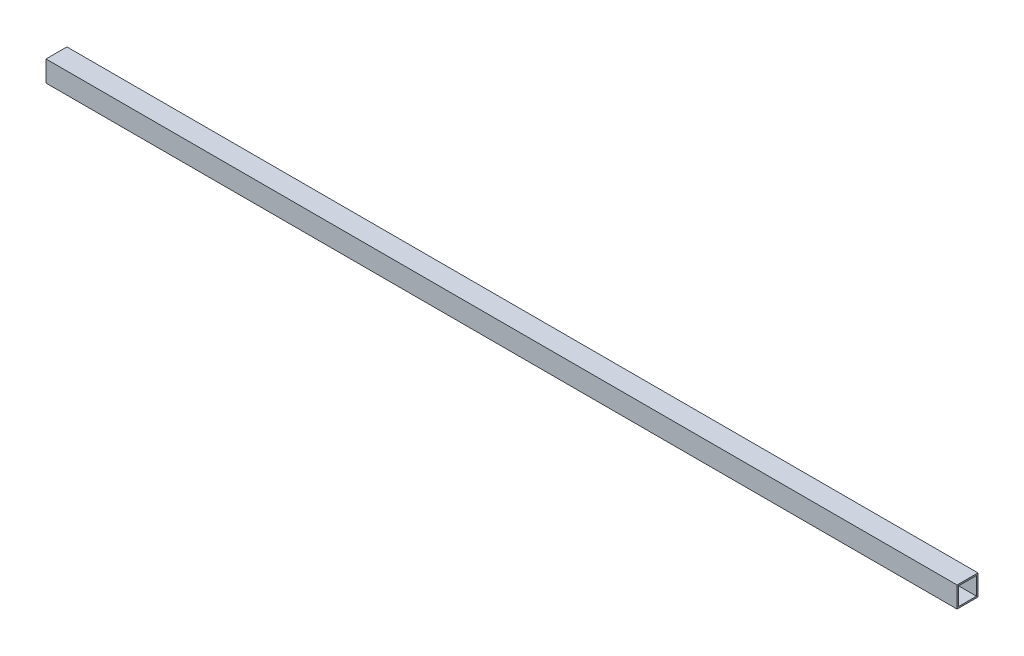
ISO-10303-21;
HEADER;
FILE_DESCRIPTION(('STEP AP214'),'2;1');
FILE_NAME('part.step','',(''),(''),'','','');
FILE_SCHEMA(('AUTOMOTIVE_DESIGN { 1 0 10303 214 1 1 1 1 }'));
ENDSEC;
DATA;
#1=APPLICATION_CONTEXT('core data for automotive mechanical design processes');
#2=APPLICATION_PROTOCOL_DEFINITION('international standard','automotive_design',2000,#1);
#3=PRODUCT_CONTEXT('',#1,'mechanical');
#4=PRODUCT('Part','Part','',(#3));
#5=PRODUCT_RELATED_PRODUCT_CATEGORY('part','',(#4));
#6=PRODUCT_DEFINITION_FORMATION('','',#4);
#7=PRODUCT_DEFINITION_CONTEXT('part definition',#1,'design');
#8=PRODUCT_DEFINITION('design','',#6,#7);
#9=PRODUCT_DEFINITION_SHAPE('','',#8);
#10=(LENGTH_UNIT() NAMED_UNIT(*) SI_UNIT(.MILLI.,.METRE.));
#11=(NAMED_UNIT(*) PLANE_ANGLE_UNIT() SI_UNIT($,.RADIAN.));
#12=(NAMED_UNIT(*) SI_UNIT($,.STERADIAN.) SOLID_ANGLE_UNIT());
#13=UNCERTAINTY_MEASURE_WITH_UNIT(LENGTH_MEASURE(1.E-05),#10,'distance_accuracy_value','');
#14=(GEOMETRIC_REPRESENTATION_CONTEXT(3) GLOBAL_UNCERTAINTY_ASSIGNED_CONTEXT((#13)) GLOBAL_UNIT_ASSIGNED_CONTEXT((#10,
#11,#12)) REPRESENTATION_CONTEXT('',''));
#15=CARTESIAN_POINT('',(0.,0.,0.));
#16=DIRECTION('',(0.,0.,1.));
#17=DIRECTION('',(1.,0.,0.));
#18=AXIS2_PLACEMENT_3D('',#15,#16,#17);
#19=CARTESIAN_POINT('',(1936.75,0.,0.));
#20=DIRECTION('',(-1.,0.,0.));
#21=DIRECTION('',(0.,0.,1.));
#22=AXIS2_PLACEMENT_3D('',#19,#20,#21);
#23=PLANE('',#22);
#24=DIRECTION('',(0.,-1.,0.));
#25=VECTOR('',#24,1.);
#26=CARTESIAN_POINT('',(1936.75,0.,0.));
#27=LINE('',#26,#25);
#28=CARTESIAN_POINT('',(1936.75,44.45,0.));
#29=VERTEX_POINT('',#28);
#30=CARTESIAN_POINT('',(1936.75,0.,0.));
#31=VERTEX_POINT('',#30);
#32=EDGE_CURVE('E135',#29,#31,#27,.T.);
#33=ORIENTED_EDGE('',*,*,#32,.T.);
#34=DIRECTION('',(0.,0.,-1.));
#35=VECTOR('',#34,1.);
#36=CARTESIAN_POINT('',(1936.75,0.,0.));
#37=LINE('',#36,#35);
#38=CARTESIAN_POINT('',(1936.75,0.,-44.45));
#39=VERTEX_POINT('',#38);
#40=EDGE_CURVE('E138',#31,#39,#37,.T.);
#41=ORIENTED_EDGE('',*,*,#40,.T.);
#42=DIRECTION('',(0.,1.,0.));
#43=VECTOR('',#42,1.);
#44=CARTESIAN_POINT('',(1936.75,0.,-44.45));
#45=LINE('',#44,#43);
#46=CARTESIAN_POINT('',(1936.75,44.45,-44.45));
#47=VERTEX_POINT('',#46);
#48=EDGE_CURVE('E141',#39,#47,#45,.T.);
#49=ORIENTED_EDGE('',*,*,#48,.T.);
#50=DIRECTION('',(0.,0.,1.));
#51=VECTOR('',#50,1.);
#52=CARTESIAN_POINT('',(1936.75,44.45,0.));
#53=LINE('',#52,#51);
#54=EDGE_CURVE('E143',#47,#29,#53,.T.);
#55=ORIENTED_EDGE('',*,*,#54,.T.);
#56=EDGE_LOOP('',(#33,#41,#49,#55));
#57=FACE_BOUND('',#56,.T.);
#58=DIRECTION('',(0.,-1.,0.));
#59=VECTOR('',#58,1.);
#60=CARTESIAN_POINT('',(1936.75,41.275,-3.175));
#61=LINE('',#60,#59);
#62=CARTESIAN_POINT('',(1936.75,41.275,-3.175));
#63=VERTEX_POINT('',#62);
#64=CARTESIAN_POINT('',(1936.75,3.175,-3.175));
#65=VERTEX_POINT('',#64);
#66=EDGE_CURVE('E99',#63,#65,#61,.T.);
#67=ORIENTED_EDGE('',*,*,#66,.F.);
#68=DIRECTION('',(0.,0.,1.));
#69=VECTOR('',#68,1.);
#70=CARTESIAN_POINT('',(1936.75,41.275,-3.175));
#71=LINE('',#70,#69);
#72=CARTESIAN_POINT('',(1936.75,41.275,-41.275));
#73=VERTEX_POINT('',#72);
#74=EDGE_CURVE('E121',#73,#63,#71,.T.);
#75=ORIENTED_EDGE('',*,*,#74,.F.);
#76=DIRECTION('',(0.,1.,0.));
#77=VECTOR('',#76,1.);
#78=CARTESIAN_POINT('',(1936.75,41.275,-41.275));
#79=LINE('',#78,#77);
#80=CARTESIAN_POINT('',(1936.75,3.175,-41.275));
#81=VERTEX_POINT('',#80);
#82=EDGE_CURVE('E119',#81,#73,#79,.T.);
#83=ORIENTED_EDGE('',*,*,#82,.F.);
#84=DIRECTION('',(0.,0.,-1.));
#85=VECTOR('',#84,1.);
#86=CARTESIAN_POINT('',(1936.75,3.175,-3.175));
#87=LINE('',#86,#85);
#88=EDGE_CURVE('E107',#65,#81,#87,.T.);
#89=ORIENTED_EDGE('',*,*,#88,.F.);
#90=EDGE_LOOP('',(#67,#75,#83,#89));
#91=FACE_BOUND('',#90,.T.);
#92=ADVANCED_FACE('F34',(#57,#91),#23,.F.);
#93=CARTESIAN_POINT('',(0.,0.,0.));
#94=DIRECTION('',(-1.,0.,0.));
#95=DIRECTION('',(0.,0.,1.));
#96=AXIS2_PLACEMENT_3D('',#93,#94,#95);
#97=PLANE('',#96);
#98=DIRECTION('',(0.,-1.,0.));
#99=VECTOR('',#98,1.);
#100=CARTESIAN_POINT('',(0.,0.,0.));
#101=LINE('',#100,#99);
#102=CARTESIAN_POINT('',(0.,44.45,0.));
#103=VERTEX_POINT('',#102);
#104=CARTESIAN_POINT('',(0.,0.,0.));
#105=VERTEX_POINT('',#104);
#106=EDGE_CURVE('E115',#103,#105,#101,.T.);
#107=ORIENTED_EDGE('',*,*,#106,.F.);
#108=DIRECTION('',(0.,0.,1.));
#109=VECTOR('',#108,1.);
#110=CARTESIAN_POINT('',(0.,44.45,0.));
#111=LINE('',#110,#109);
#112=CARTESIAN_POINT('',(0.,44.45,-44.45));
#113=VERTEX_POINT('',#112);
#114=EDGE_CURVE('E139',#113,#103,#111,.T.);
#115=ORIENTED_EDGE('',*,*,#114,.F.);
#116=DIRECTION('',(0.,1.,0.));
#117=VECTOR('',#116,1.);
#118=CARTESIAN_POINT('',(0.,0.,-44.45));
#119=LINE('',#118,#117);
#120=CARTESIAN_POINT('',(0.,0.,-44.45));
#121=VERTEX_POINT('',#120);
#122=EDGE_CURVE('E150',#121,#113,#119,.T.);
#123=ORIENTED_EDGE('',*,*,#122,.F.);
#124=DIRECTION('',(0.,0.,-1.));
#125=VECTOR('',#124,1.);
#126=CARTESIAN_POINT('',(0.,0.,0.));
#127=LINE('',#126,#125);
#128=EDGE_CURVE('E148',#105,#121,#127,.T.);
#129=ORIENTED_EDGE('',*,*,#128,.F.);
#130=EDGE_LOOP('',(#107,#115,#123,#129));
#131=FACE_BOUND('',#130,.T.);
#132=DIRECTION('',(0.,0.,1.));
#133=VECTOR('',#132,1.);
#134=CARTESIAN_POINT('',(0.,41.275,-3.175));
#135=LINE('',#134,#133);
#136=CARTESIAN_POINT('',(0.,41.275,-41.275));
#137=VERTEX_POINT('',#136);
#138=CARTESIAN_POINT('',(0.,41.275,-3.175));
#139=VERTEX_POINT('',#138);
#140=EDGE_CURVE('E108',#137,#139,#135,.T.);
#141=ORIENTED_EDGE('',*,*,#140,.T.);
#142=DIRECTION('',(0.,-1.,0.));
#143=VECTOR('',#142,1.);
#144=CARTESIAN_POINT('',(0.,41.275,-3.175));
#145=LINE('',#144,#143);
#146=CARTESIAN_POINT('',(0.,3.175,-3.175));
#147=VERTEX_POINT('',#146);
#148=EDGE_CURVE('E57',#139,#147,#145,.T.);
#149=ORIENTED_EDGE('',*,*,#148,.T.);
#150=DIRECTION('',(0.,0.,-1.));
#151=VECTOR('',#150,1.);
#152=CARTESIAN_POINT('',(0.,3.175,-3.175));
#153=LINE('',#152,#151);
#154=CARTESIAN_POINT('',(0.,3.175,-41.275));
#155=VERTEX_POINT('',#154);
#156=EDGE_CURVE('E114',#147,#155,#153,.T.);
#157=ORIENTED_EDGE('',*,*,#156,.T.);
#158=DIRECTION('',(0.,1.,0.));
#159=VECTOR('',#158,1.);
#160=CARTESIAN_POINT('',(0.,41.275,-41.275));
#161=LINE('',#160,#159);
#162=EDGE_CURVE('E127',#155,#137,#161,.T.);
#163=ORIENTED_EDGE('',*,*,#162,.T.);
#164=EDGE_LOOP('',(#141,#149,#157,#163));
#165=FACE_BOUND('',#164,.T.);
#166=ADVANCED_FACE('F168',(#131,#165),#97,.T.);
#167=CARTESIAN_POINT('',(1936.75,0.,0.));
#168=DIRECTION('',(0.,0.,-1.));
#169=DIRECTION('',(-1.,0.,0.));
#170=AXIS2_PLACEMENT_3D('',#167,#168,#169);
#171=PLANE('',#170);
#172=ORIENTED_EDGE('',*,*,#106,.T.);
#173=DIRECTION('',(-1.,0.,0.));
#174=VECTOR('',#173,1.);
#175=CARTESIAN_POINT('',(1936.75,0.,0.));
#176=LINE('',#175,#174);
#177=EDGE_CURVE('E11',#31,#105,#176,.T.);
#178=ORIENTED_EDGE('',*,*,#177,.F.);
#179=ORIENTED_EDGE('',*,*,#32,.F.);
#180=DIRECTION('',(-1.,0.,0.));
#181=VECTOR('',#180,1.);
#182=CARTESIAN_POINT('',(1936.75,44.45,0.));
#183=LINE('',#182,#181);
#184=EDGE_CURVE('E145',#29,#103,#183,.T.);
#185=ORIENTED_EDGE('',*,*,#184,.T.);
#186=EDGE_LOOP('',(#172,#178,#179,#185));
#187=FACE_BOUND('',#186,.T.);
#188=ADVANCED_FACE('F36',(#187),#171,.F.);
#189=CARTESIAN_POINT('',(1936.75,0.,0.));
#190=DIRECTION('',(0.,1.,0.));
#191=DIRECTION('',(0.,0.,1.));
#192=AXIS2_PLACEMENT_3D('',#189,#190,#191);
#193=PLANE('',#192);
#194=ORIENTED_EDGE('',*,*,#128,.T.);
#195=DIRECTION('',(-1.,0.,0.));
#196=VECTOR('',#195,1.);
#197=CARTESIAN_POINT('',(1936.75,0.,-44.45));
#198=LINE('',#197,#196);
#199=EDGE_CURVE('E42',#39,#121,#198,.T.);
#200=ORIENTED_EDGE('',*,*,#199,.F.);
#201=ORIENTED_EDGE('',*,*,#40,.F.);
#202=ORIENTED_EDGE('',*,*,#177,.T.);
#203=EDGE_LOOP('',(#194,#200,#201,#202));
#204=FACE_BOUND('',#203,.T.);
#205=ADVANCED_FACE('F178',(#204),#193,.F.);
#206=CARTESIAN_POINT('',(1936.75,0.,-44.45));
#207=DIRECTION('',(0.,0.,1.));
#208=DIRECTION('',(1.,0.,0.));
#209=AXIS2_PLACEMENT_3D('',#206,#207,#208);
#210=PLANE('',#209);
#211=ORIENTED_EDGE('',*,*,#122,.T.);
#212=DIRECTION('',(-1.,0.,0.));
#213=VECTOR('',#212,1.);
#214=CARTESIAN_POINT('',(1936.75,44.45,-44.45));
#215=LINE('',#214,#213);
#216=EDGE_CURVE('E155',#47,#113,#215,.T.);
#217=ORIENTED_EDGE('',*,*,#216,.F.);
#218=ORIENTED_EDGE('',*,*,#48,.F.);
#219=ORIENTED_EDGE('',*,*,#199,.T.);
#220=EDGE_LOOP('',(#211,#217,#218,#219));
#221=FACE_BOUND('',#220,.T.);
#222=ADVANCED_FACE('F162',(#221),#210,.F.);
#223=CARTESIAN_POINT('',(1936.75,44.45,0.));
#224=DIRECTION('',(0.,-1.,0.));
#225=DIRECTION('',(0.,0.,-1.));
#226=AXIS2_PLACEMENT_3D('',#223,#224,#225);
#227=PLANE('',#226);
#228=ORIENTED_EDGE('',*,*,#114,.T.);
#229=ORIENTED_EDGE('',*,*,#184,.F.);
#230=ORIENTED_EDGE('',*,*,#54,.F.);
#231=ORIENTED_EDGE('',*,*,#216,.T.);
#232=EDGE_LOOP('',(#228,#229,#230,#231));
#233=FACE_BOUND('',#232,.T.);
#234=ADVANCED_FACE('F172',(#233),#227,.F.);
#235=CARTESIAN_POINT('',(1936.75,41.275,-3.175));
#236=DIRECTION('',(0.,0.,-1.));
#237=DIRECTION('',(0.,1.,0.));
#238=AXIS2_PLACEMENT_3D('',#235,#236,#237);
#239=PLANE('',#238);
#240=ORIENTED_EDGE('',*,*,#148,.F.);
#241=DIRECTION('',(-1.,0.,0.));
#242=VECTOR('',#241,1.);
#243=CARTESIAN_POINT('',(1936.75,41.275,-3.175));
#244=LINE('',#243,#242);
#245=EDGE_CURVE('E103',#63,#139,#244,.T.);
#246=ORIENTED_EDGE('',*,*,#245,.F.);
#247=ORIENTED_EDGE('',*,*,#66,.T.);
#248=DIRECTION('',(-1.,0.,0.));
#249=VECTOR('',#248,1.);
#250=CARTESIAN_POINT('',(1936.75,3.175,-3.175));
#251=LINE('',#250,#249);
#252=EDGE_CURVE('E102',#65,#147,#251,.T.);
#253=ORIENTED_EDGE('',*,*,#252,.T.);
#254=EDGE_LOOP('',(#240,#246,#247,#253));
#255=FACE_BOUND('',#254,.T.);
#256=ADVANCED_FACE('F101',(#255),#239,.T.);
#257=CARTESIAN_POINT('',(1936.75,3.175,-3.175));
#258=DIRECTION('',(0.,1.,0.));
#259=DIRECTION('',(0.,0.,1.));
#260=AXIS2_PLACEMENT_3D('',#257,#258,#259);
#261=PLANE('',#260);
#262=ORIENTED_EDGE('',*,*,#156,.F.);
#263=ORIENTED_EDGE('',*,*,#252,.F.);
#264=ORIENTED_EDGE('',*,*,#88,.T.);
#265=DIRECTION('',(-1.,0.,0.));
#266=VECTOR('',#265,1.);
#267=CARTESIAN_POINT('',(1936.75,3.175,-41.275));
#268=LINE('',#267,#266);
#269=EDGE_CURVE('E116',#81,#155,#268,.T.);
#270=ORIENTED_EDGE('',*,*,#269,.T.);
#271=EDGE_LOOP('',(#262,#263,#264,#270));
#272=FACE_BOUND('',#271,.T.);
#273=ADVANCED_FACE('F111',(#272),#261,.T.);
#274=CARTESIAN_POINT('',(1936.75,41.275,-41.275));
#275=DIRECTION('',(0.,0.,1.));
#276=DIRECTION('',(0.,-1.,0.));
#277=AXIS2_PLACEMENT_3D('',#274,#275,#276);
#278=PLANE('',#277);
#279=ORIENTED_EDGE('',*,*,#162,.F.);
#280=ORIENTED_EDGE('',*,*,#269,.F.);
#281=ORIENTED_EDGE('',*,*,#82,.T.);
#282=DIRECTION('',(-1.,0.,0.));
#283=VECTOR('',#282,1.);
#284=CARTESIAN_POINT('',(1936.75,41.275,-41.275));
#285=LINE('',#284,#283);
#286=EDGE_CURVE('E49',#73,#137,#285,.T.);
#287=ORIENTED_EDGE('',*,*,#286,.T.);
#288=EDGE_LOOP('',(#279,#280,#281,#287));
#289=FACE_BOUND('',#288,.T.);
#290=ADVANCED_FACE('F201',(#289),#278,.T.);
#291=CARTESIAN_POINT('',(1936.75,41.275,-3.175));
#292=DIRECTION('',(0.,-1.,0.));
#293=DIRECTION('',(0.,0.,-1.));
#294=AXIS2_PLACEMENT_3D('',#291,#292,#293);
#295=PLANE('',#294);
#296=ORIENTED_EDGE('',*,*,#140,.F.);
#297=ORIENTED_EDGE('',*,*,#286,.F.);
#298=ORIENTED_EDGE('',*,*,#74,.T.);
#299=ORIENTED_EDGE('',*,*,#245,.T.);
#300=EDGE_LOOP('',(#296,#297,#298,#299));
#301=FACE_BOUND('',#300,.T.);
#302=ADVANCED_FACE('F205',(#301),#295,.T.);
#303=CLOSED_SHELL('',(#92,#166,#188,#205,#222,#234,#256,#273,#290,#302));
#304=MANIFOLD_SOLID_BREP('B2',#303);
#305=ADVANCED_BREP_SHAPE_REPRESENTATION('',(#18,#304),#14);
#306=SHAPE_DEFINITION_REPRESENTATION(#9,#305);
ENDSEC;
END-ISO-10303-21;
